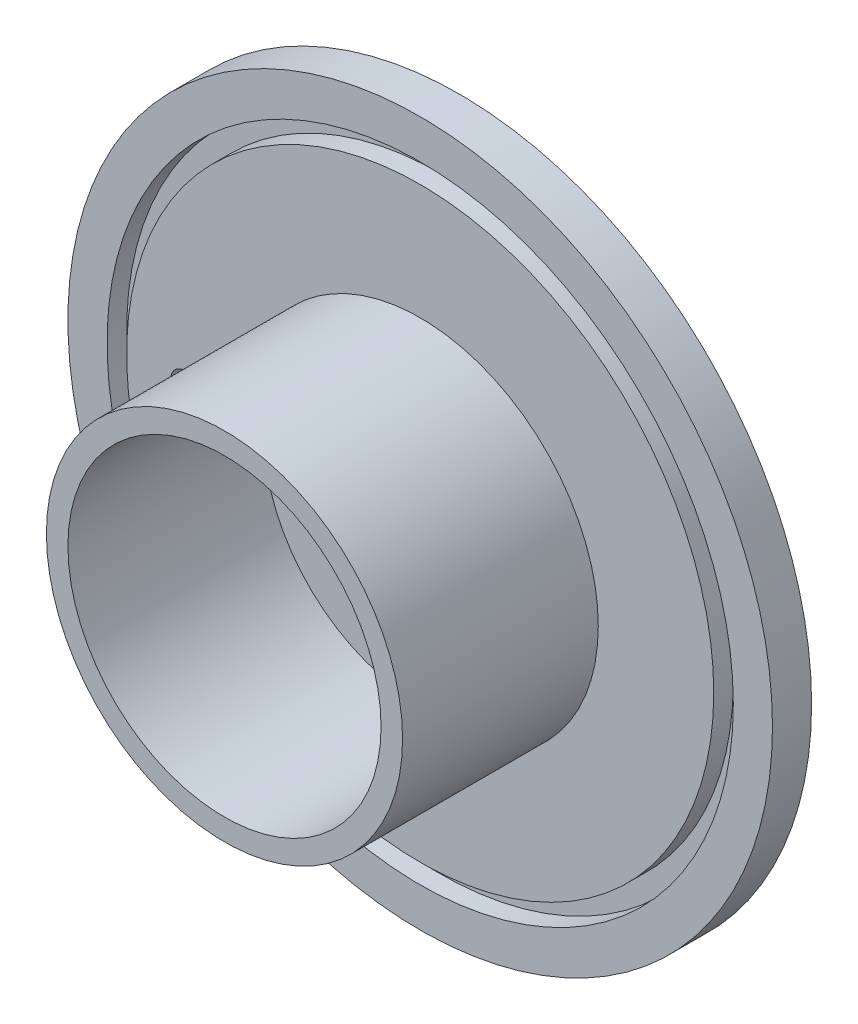
ISO-10303-21;
HEADER;
FILE_DESCRIPTION(('STEP AP214'),'2;1');
FILE_NAME('part.step','',(''),(''),'','','');
FILE_SCHEMA(('AUTOMOTIVE_DESIGN { 1 0 10303 214 1 1 1 1 }'));
ENDSEC;
DATA;
#1=APPLICATION_CONTEXT('core data for automotive mechanical design processes');
#2=APPLICATION_PROTOCOL_DEFINITION('international standard','automotive_design',2000,#1);
#3=PRODUCT_CONTEXT('',#1,'mechanical');
#4=PRODUCT('Part','Part','',(#3));
#5=PRODUCT_RELATED_PRODUCT_CATEGORY('part','',(#4));
#6=PRODUCT_DEFINITION_FORMATION('','',#4);
#7=PRODUCT_DEFINITION_CONTEXT('part definition',#1,'design');
#8=PRODUCT_DEFINITION('design','',#6,#7);
#9=PRODUCT_DEFINITION_SHAPE('','',#8);
#10=(LENGTH_UNIT() NAMED_UNIT(*) SI_UNIT(.MILLI.,.METRE.));
#11=(NAMED_UNIT(*) PLANE_ANGLE_UNIT() SI_UNIT($,.RADIAN.));
#12=(NAMED_UNIT(*) SI_UNIT($,.STERADIAN.) SOLID_ANGLE_UNIT());
#13=UNCERTAINTY_MEASURE_WITH_UNIT(LENGTH_MEASURE(1.E-05),#10,'distance_accuracy_value','');
#14=(GEOMETRIC_REPRESENTATION_CONTEXT(3) GLOBAL_UNCERTAINTY_ASSIGNED_CONTEXT((#13)) GLOBAL_UNIT_ASSIGNED_CONTEXT((#10,
#11,#12)) REPRESENTATION_CONTEXT('',''));
#15=CARTESIAN_POINT('',(0.,0.,0.));
#16=DIRECTION('',(0.,0.,1.));
#17=DIRECTION('',(1.,0.,0.));
#18=AXIS2_PLACEMENT_3D('',#15,#16,#17);
#19=CARTESIAN_POINT('',(0.,0.,6.35));
#20=DIRECTION('',(0.,0.,-1.));
#21=DIRECTION('',(-1.,0.,0.));
#22=AXIS2_PLACEMENT_3D('',#19,#20,#21);
#23=CYLINDRICAL_SURFACE('',#22,2.38125);
#24=CARTESIAN_POINT('',(0.,0.,6.35));
#25=DIRECTION('',(0.,0.,1.));
#26=DIRECTION('',(1.,0.,0.));
#27=AXIS2_PLACEMENT_3D('',#24,#25,#26);
#28=CIRCLE('',#27,2.38125);
#29=CARTESIAN_POINT('',(2.38125,0.,6.35));
#30=VERTEX_POINT('',#29);
#31=EDGE_CURVE('E11',#30,#30,#28,.T.);
#32=ORIENTED_EDGE('',*,*,#31,.T.);
#33=EDGE_LOOP('',(#32));
#34=FACE_BOUND('',#33,.T.);
#35=CARTESIAN_POINT('',(0.,0.,0.));
#36=DIRECTION('',(0.,0.,1.));
#37=DIRECTION('',(1.,0.,0.));
#38=AXIS2_PLACEMENT_3D('',#35,#36,#37);
#39=CIRCLE('',#38,2.38125);
#40=CARTESIAN_POINT('',(2.38125,0.,0.));
#41=VERTEX_POINT('',#40);
#42=EDGE_CURVE('E434',#41,#41,#39,.T.);
#43=ORIENTED_EDGE('',*,*,#42,.F.);
#44=EDGE_LOOP('',(#43));
#45=FACE_BOUND('',#44,.T.);
#46=ADVANCED_FACE('F428',(#34,#45),#23,.F.);
#47=CARTESIAN_POINT('',(0.,-125.871421356237,6.35));
#48=DIRECTION('',(0.,0.,1.));
#49=DIRECTION('',(1.,0.,0.));
#50=AXIS2_PLACEMENT_3D('',#47,#48,#49);
#51=PLANE('',#50);
#52=ORIENTED_EDGE('',*,*,#31,.F.);
#53=EDGE_LOOP('',(#52));
#54=FACE_BOUND('',#53,.T.);
#55=CARTESIAN_POINT('',(0.,0.,6.35));
#56=DIRECTION('',(0.,0.,1.));
#57=DIRECTION('',(1.,0.,0.));
#58=AXIS2_PLACEMENT_3D('',#55,#56,#57);
#59=CIRCLE('',#58,25.4);
#60=CARTESIAN_POINT('',(25.4,0.,6.35));
#61=VERTEX_POINT('',#60);
#62=EDGE_CURVE('E438',#61,#61,#59,.F.);
#63=ORIENTED_EDGE('',*,*,#62,.F.);
#64=EDGE_LOOP('',(#63));
#65=FACE_BOUND('',#64,.T.);
#66=ADVANCED_FACE('F497',(#54,#65),#51,.T.);
#67=CARTESIAN_POINT('',(0.,-125.871421356237,0.));
#68=DIRECTION('',(0.,0.,1.));
#69=DIRECTION('',(1.,0.,0.));
#70=AXIS2_PLACEMENT_3D('',#67,#68,#69);
#71=PLANE('',#70);
#72=ORIENTED_EDGE('',*,*,#42,.T.);
#73=EDGE_LOOP('',(#72));
#74=FACE_BOUND('',#73,.T.);
#75=CARTESIAN_POINT('',(0.,0.,0.));
#76=DIRECTION('',(0.,0.,1.));
#77=DIRECTION('',(1.,0.,0.));
#78=AXIS2_PLACEMENT_3D('',#75,#76,#77);
#79=CIRCLE('',#78,57.15);
#80=CARTESIAN_POINT('',(57.15,0.,0.));
#81=VERTEX_POINT('',#80);
#82=EDGE_CURVE('E459',#81,#81,#79,.T.);
#83=ORIENTED_EDGE('',*,*,#82,.F.);
#84=EDGE_LOOP('',(#83));
#85=FACE_BOUND('',#84,.T.);
#86=CARTESIAN_POINT('',(-38.1,0.,0.));
#87=DIRECTION('',(0.,0.,1.));
#88=DIRECTION('',(1.,0.,0.));
#89=AXIS2_PLACEMENT_3D('',#86,#87,#88);
#90=CIRCLE('',#89,2.38125);
#91=CARTESIAN_POINT('',(-35.71875,0.,0.));
#92=VERTEX_POINT('',#91);
#93=EDGE_CURVE('E474',#92,#92,#90,.T.);
#94=ORIENTED_EDGE('',*,*,#93,.T.);
#95=EDGE_LOOP('',(#94));
#96=FACE_BOUND('',#95,.T.);
#97=ADVANCED_FACE('F478',(#74,#85,#96),#71,.F.);
#98=CARTESIAN_POINT('',(0.,0.,38.1));
#99=DIRECTION('',(0.,0.,-1.));
#100=DIRECTION('',(-1.,0.,0.));
#101=AXIS2_PLACEMENT_3D('',#98,#99,#100);
#102=CYLINDRICAL_SURFACE('',#101,25.4);
#103=ORIENTED_EDGE('',*,*,#62,.T.);
#104=EDGE_LOOP('',(#103));
#105=FACE_BOUND('',#104,.T.);
#106=CARTESIAN_POINT('',(0.,0.,38.1));
#107=DIRECTION('',(0.,0.,1.));
#108=DIRECTION('',(1.,0.,0.));
#109=AXIS2_PLACEMENT_3D('',#106,#107,#108);
#110=CIRCLE('',#109,25.4);
#111=CARTESIAN_POINT('',(25.4,0.,38.1));
#112=VERTEX_POINT('',#111);
#113=EDGE_CURVE('E447',#112,#112,#110,.T.);
#114=ORIENTED_EDGE('',*,*,#113,.T.);
#115=EDGE_LOOP('',(#114));
#116=FACE_BOUND('',#115,.T.);
#117=ADVANCED_FACE('F506',(#105,#116),#102,.F.);
#118=CARTESIAN_POINT('',(0.,0.,38.1));
#119=DIRECTION('',(0.,0.,-1.));
#120=DIRECTION('',(-1.,0.,0.));
#121=AXIS2_PLACEMENT_3D('',#118,#119,#120);
#122=CYLINDRICAL_SURFACE('',#121,28.8925);
#123=CARTESIAN_POINT('',(0.,0.,6.35));
#124=DIRECTION('',(0.,0.,1.));
#125=DIRECTION('',(1.,0.,0.));
#126=AXIS2_PLACEMENT_3D('',#123,#124,#125);
#127=CIRCLE('',#126,28.8925);
#128=CARTESIAN_POINT('',(28.8925,0.,6.35));
#129=VERTEX_POINT('',#128);
#130=EDGE_CURVE('E468',#129,#129,#127,.T.);
#131=ORIENTED_EDGE('',*,*,#130,.T.);
#132=EDGE_LOOP('',(#131));
#133=FACE_BOUND('',#132,.T.);
#134=CARTESIAN_POINT('',(0.,0.,38.1));
#135=DIRECTION('',(0.,0.,1.));
#136=DIRECTION('',(1.,0.,0.));
#137=AXIS2_PLACEMENT_3D('',#134,#135,#136);
#138=CIRCLE('',#137,28.8925);
#139=CARTESIAN_POINT('',(28.8925,0.,38.1));
#140=VERTEX_POINT('',#139);
#141=EDGE_CURVE('E442',#140,#140,#138,.T.);
#142=ORIENTED_EDGE('',*,*,#141,.F.);
#143=EDGE_LOOP('',(#142));
#144=FACE_BOUND('',#143,.T.);
#145=ADVANCED_FACE('F512',(#133,#144),#122,.T.);
#146=CARTESIAN_POINT('',(0.,-125.871421356237,38.1));
#147=DIRECTION('',(0.,0.,1.));
#148=DIRECTION('',(1.,0.,0.));
#149=AXIS2_PLACEMENT_3D('',#146,#147,#148);
#150=PLANE('',#149);
#151=ORIENTED_EDGE('',*,*,#113,.F.);
#152=EDGE_LOOP('',(#151));
#153=FACE_BOUND('',#152,.T.);
#154=ORIENTED_EDGE('',*,*,#141,.T.);
#155=EDGE_LOOP('',(#154));
#156=FACE_BOUND('',#155,.T.);
#157=ADVANCED_FACE('F516',(#153,#156),#150,.T.);
#158=CARTESIAN_POINT('',(0.,0.,6.35));
#159=DIRECTION('',(0.,0.,-1.));
#160=DIRECTION('',(-1.,0.,0.));
#161=AXIS2_PLACEMENT_3D('',#158,#159,#160);
#162=CYLINDRICAL_SURFACE('',#161,50.8);
#163=CARTESIAN_POINT('',(0.,0.,3.175));
#164=DIRECTION('',(0.,0.,1.));
#165=DIRECTION('',(1.,0.,0.));
#166=AXIS2_PLACEMENT_3D('',#163,#164,#165);
#167=CIRCLE('',#166,50.8);
#168=CARTESIAN_POINT('',(50.8,0.,3.175));
#169=VERTEX_POINT('',#168);
#170=EDGE_CURVE('E450',#169,#169,#167,.T.);
#171=ORIENTED_EDGE('',*,*,#170,.F.);
#172=EDGE_LOOP('',(#171));
#173=FACE_BOUND('',#172,.T.);
#174=CARTESIAN_POINT('',(0.,0.,6.35));
#175=DIRECTION('',(0.,0.,1.));
#176=DIRECTION('',(1.,0.,0.));
#177=AXIS2_PLACEMENT_3D('',#174,#175,#176);
#178=CIRCLE('',#177,50.8);
#179=CARTESIAN_POINT('',(50.8,0.,6.35));
#180=VERTEX_POINT('',#179);
#181=EDGE_CURVE('E456',#180,#180,#178,.T.);
#182=ORIENTED_EDGE('',*,*,#181,.T.);
#183=EDGE_LOOP('',(#182));
#184=FACE_BOUND('',#183,.T.);
#185=ADVANCED_FACE('F520',(#173,#184),#162,.F.);
#186=CARTESIAN_POINT('',(0.,0.,6.35));
#187=DIRECTION('',(0.,0.,-1.));
#188=DIRECTION('',(-1.,0.,0.));
#189=AXIS2_PLACEMENT_3D('',#186,#187,#188);
#190=CYLINDRICAL_SURFACE('',#189,57.15);
#191=CARTESIAN_POINT('',(0.,0.,6.35));
#192=DIRECTION('',(0.,0.,1.));
#193=DIRECTION('',(1.,0.,0.));
#194=AXIS2_PLACEMENT_3D('',#191,#192,#193);
#195=CIRCLE('',#194,57.15);
#196=CARTESIAN_POINT('',(57.15,0.,6.35));
#197=VERTEX_POINT('',#196);
#198=EDGE_CURVE('E453',#197,#197,#195,.T.);
#199=ORIENTED_EDGE('',*,*,#198,.F.);
#200=EDGE_LOOP('',(#199));
#201=FACE_BOUND('',#200,.T.);
#202=ORIENTED_EDGE('',*,*,#82,.T.);
#203=EDGE_LOOP('',(#202));
#204=FACE_BOUND('',#203,.T.);
#205=ADVANCED_FACE('F524',(#201,#204),#190,.T.);
#206=CARTESIAN_POINT('',(0.,-125.871421356237,6.35));
#207=DIRECTION('',(0.,0.,1.));
#208=DIRECTION('',(1.,0.,0.));
#209=AXIS2_PLACEMENT_3D('',#206,#207,#208);
#210=PLANE('',#209);
#211=ORIENTED_EDGE('',*,*,#181,.F.);
#212=EDGE_LOOP('',(#211));
#213=FACE_BOUND('',#212,.T.);
#214=ORIENTED_EDGE('',*,*,#198,.T.);
#215=EDGE_LOOP('',(#214));
#216=FACE_BOUND('',#215,.T.);
#217=ADVANCED_FACE('F493',(#213,#216),#210,.T.);
#218=CARTESIAN_POINT('',(0.,-125.871421356237,3.175));
#219=DIRECTION('',(0.,0.,1.));
#220=DIRECTION('',(1.,0.,0.));
#221=AXIS2_PLACEMENT_3D('',#218,#219,#220);
#222=PLANE('',#221);
#223=CARTESIAN_POINT('',(0.,0.,3.175));
#224=DIRECTION('',(0.,0.,1.));
#225=DIRECTION('',(1.,0.,0.));
#226=AXIS2_PLACEMENT_3D('',#223,#224,#225);
#227=CIRCLE('',#226,47.625);
#228=CARTESIAN_POINT('',(47.625,0.,3.175));
#229=VERTEX_POINT('',#228);
#230=EDGE_CURVE('E462',#229,#229,#227,.T.);
#231=ORIENTED_EDGE('',*,*,#230,.F.);
#232=EDGE_LOOP('',(#231));
#233=FACE_BOUND('',#232,.T.);
#234=ORIENTED_EDGE('',*,*,#170,.T.);
#235=EDGE_LOOP('',(#234));
#236=FACE_BOUND('',#235,.T.);
#237=ADVANCED_FACE('F483',(#233,#236),#222,.T.);
#238=CARTESIAN_POINT('',(-38.1,0.,6.35));
#239=DIRECTION('',(0.,0.,-1.));
#240=DIRECTION('',(-1.,0.,0.));
#241=AXIS2_PLACEMENT_3D('',#238,#239,#240);
#242=CYLINDRICAL_SURFACE('',#241,2.38125);
#243=CARTESIAN_POINT('',(-38.1,0.,6.35));
#244=DIRECTION('',(0.,0.,1.));
#245=DIRECTION('',(1.,0.,0.));
#246=AXIS2_PLACEMENT_3D('',#243,#244,#245);
#247=CIRCLE('',#246,2.38125);
#248=CARTESIAN_POINT('',(-35.71875,0.,6.35));
#249=VERTEX_POINT('',#248);
#250=EDGE_CURVE('E471',#249,#249,#247,.T.);
#251=ORIENTED_EDGE('',*,*,#250,.T.);
#252=EDGE_LOOP('',(#251));
#253=FACE_BOUND('',#252,.T.);
#254=ORIENTED_EDGE('',*,*,#93,.F.);
#255=EDGE_LOOP('',(#254));
#256=FACE_BOUND('',#255,.T.);
#257=ADVANCED_FACE('F480',(#253,#256),#242,.F.);
#258=CARTESIAN_POINT('',(0.,0.,6.35));
#259=DIRECTION('',(0.,0.,-1.));
#260=DIRECTION('',(-1.,0.,0.));
#261=AXIS2_PLACEMENT_3D('',#258,#259,#260);
#262=CYLINDRICAL_SURFACE('',#261,47.625);
#263=ORIENTED_EDGE('',*,*,#230,.T.);
#264=EDGE_LOOP('',(#263));
#265=FACE_BOUND('',#264,.T.);
#266=CARTESIAN_POINT('',(0.,0.,6.35));
#267=DIRECTION('',(0.,0.,1.));
#268=DIRECTION('',(1.,0.,0.));
#269=AXIS2_PLACEMENT_3D('',#266,#267,#268);
#270=CIRCLE('',#269,47.625);
#271=CARTESIAN_POINT('',(47.625,0.,6.35));
#272=VERTEX_POINT('',#271);
#273=EDGE_CURVE('E465',#272,#272,#270,.T.);
#274=ORIENTED_EDGE('',*,*,#273,.F.);
#275=EDGE_LOOP('',(#274));
#276=FACE_BOUND('',#275,.T.);
#277=ADVANCED_FACE('F482',(#265,#276),#262,.T.);
#278=CARTESIAN_POINT('',(0.,-125.871421356237,6.35));
#279=DIRECTION('',(0.,0.,1.));
#280=DIRECTION('',(1.,0.,0.));
#281=AXIS2_PLACEMENT_3D('',#278,#279,#280);
#282=PLANE('',#281);
#283=ORIENTED_EDGE('',*,*,#250,.F.);
#284=EDGE_LOOP('',(#283));
#285=FACE_BOUND('',#284,.T.);
#286=ORIENTED_EDGE('',*,*,#130,.F.);
#287=EDGE_LOOP('',(#286));
#288=FACE_BOUND('',#287,.T.);
#289=ORIENTED_EDGE('',*,*,#273,.T.);
#290=EDGE_LOOP('',(#289));
#291=FACE_BOUND('',#290,.T.);
#292=ADVANCED_FACE('F490',(#285,#288,#291),#282,.T.);
#293=CLOSED_SHELL('',(#46,#66,#97,#117,#145,#157,#185,#205,#217,#237,#257,#277,#292));
#294=MANIFOLD_SOLID_BREP('B2',#293);
#295=ADVANCED_BREP_SHAPE_REPRESENTATION('',(#18,#294),#14);
#296=SHAPE_DEFINITION_REPRESENTATION(#9,#295);
ENDSEC;
END-ISO-10303-21;
